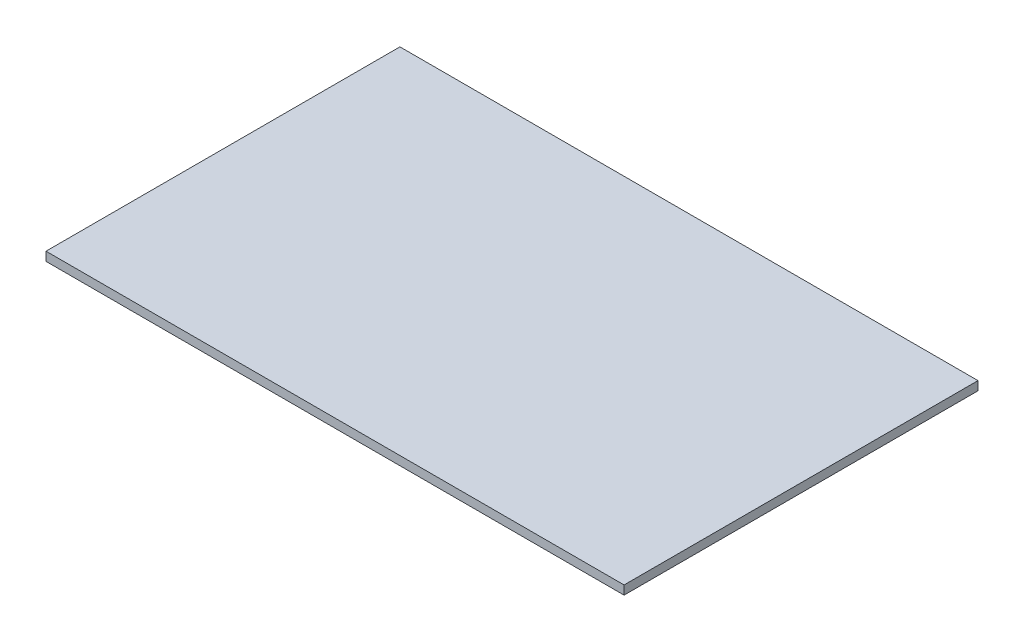
ISO-10303-21;
HEADER;
FILE_DESCRIPTION(('STEP AP214'),'2;1');
FILE_NAME('part.step','',(''),(''),'','','');
FILE_SCHEMA(('AUTOMOTIVE_DESIGN { 1 0 10303 214 1 1 1 1 }'));
ENDSEC;
DATA;
#1=APPLICATION_CONTEXT('core data for automotive mechanical design processes');
#2=APPLICATION_PROTOCOL_DEFINITION('international standard','automotive_design',2000,#1);
#3=PRODUCT_CONTEXT('',#1,'mechanical');
#4=PRODUCT('Part','Part','',(#3));
#5=PRODUCT_RELATED_PRODUCT_CATEGORY('part','',(#4));
#6=PRODUCT_DEFINITION_FORMATION('','',#4);
#7=PRODUCT_DEFINITION_CONTEXT('part definition',#1,'design');
#8=PRODUCT_DEFINITION('design','',#6,#7);
#9=PRODUCT_DEFINITION_SHAPE('','',#8);
#10=(LENGTH_UNIT() NAMED_UNIT(*) SI_UNIT(.MILLI.,.METRE.));
#11=(NAMED_UNIT(*) PLANE_ANGLE_UNIT() SI_UNIT($,.RADIAN.));
#12=(NAMED_UNIT(*) SI_UNIT($,.STERADIAN.) SOLID_ANGLE_UNIT());
#13=UNCERTAINTY_MEASURE_WITH_UNIT(LENGTH_MEASURE(1.E-05),#10,'distance_accuracy_value','');
#14=(GEOMETRIC_REPRESENTATION_CONTEXT(3) GLOBAL_UNCERTAINTY_ASSIGNED_CONTEXT((#13)) GLOBAL_UNIT_ASSIGNED_CONTEXT((#10,
#11,#12)) REPRESENTATION_CONTEXT('',''));
#15=CARTESIAN_POINT('',(0.,0.,0.));
#16=DIRECTION('',(0.,0.,1.));
#17=DIRECTION('',(1.,0.,0.));
#18=AXIS2_PLACEMENT_3D('',#15,#16,#17);
#19=CARTESIAN_POINT('',(49.,1.5,-30.));
#20=DIRECTION('',(-1.,0.,0.));
#21=DIRECTION('',(0.,0.,1.));
#22=AXIS2_PLACEMENT_3D('',#19,#20,#21);
#23=PLANE('',#22);
#24=DIRECTION('',(0.,0.,-1.));
#25=VECTOR('',#24,1.);
#26=CARTESIAN_POINT('',(49.,0.,-30.));
#27=LINE('',#26,#25);
#28=CARTESIAN_POINT('',(49.,0.,30.));
#29=VERTEX_POINT('',#28);
#30=CARTESIAN_POINT('',(49.,0.,-30.));
#31=VERTEX_POINT('',#30);
#32=EDGE_CURVE('E98',#29,#31,#27,.T.);
#33=ORIENTED_EDGE('',*,*,#32,.T.);
#34=DIRECTION('',(0.,-1.,0.));
#35=VECTOR('',#34,1.);
#36=CARTESIAN_POINT('',(49.,1.5,-30.));
#37=LINE('',#36,#35);
#38=CARTESIAN_POINT('',(49.,1.5,-30.));
#39=VERTEX_POINT('',#38);
#40=EDGE_CURVE('E11',#39,#31,#37,.T.);
#41=ORIENTED_EDGE('',*,*,#40,.F.);
#42=DIRECTION('',(0.,0.,-1.));
#43=VECTOR('',#42,1.);
#44=CARTESIAN_POINT('',(49.,1.5,-30.));
#45=LINE('',#44,#43);
#46=CARTESIAN_POINT('',(49.,1.5,30.));
#47=VERTEX_POINT('',#46);
#48=EDGE_CURVE('E86',#47,#39,#45,.T.);
#49=ORIENTED_EDGE('',*,*,#48,.F.);
#50=DIRECTION('',(0.,-1.,0.));
#51=VECTOR('',#50,1.);
#52=CARTESIAN_POINT('',(49.,1.5,30.));
#53=LINE('',#52,#51);
#54=EDGE_CURVE('E94',#47,#29,#53,.T.);
#55=ORIENTED_EDGE('',*,*,#54,.T.);
#56=EDGE_LOOP('',(#33,#41,#49,#55));
#57=FACE_BOUND('',#56,.T.);
#58=ADVANCED_FACE('F35',(#57),#23,.F.);
#59=CARTESIAN_POINT('',(-49.,1.5,-30.));
#60=DIRECTION('',(0.,0.,1.));
#61=DIRECTION('',(1.,0.,0.));
#62=AXIS2_PLACEMENT_3D('',#59,#60,#61);
#63=PLANE('',#62);
#64=DIRECTION('',(-1.,0.,0.));
#65=VECTOR('',#64,1.);
#66=CARTESIAN_POINT('',(-49.,0.,-30.));
#67=LINE('',#66,#65);
#68=CARTESIAN_POINT('',(-49.,0.,-30.));
#69=VERTEX_POINT('',#68);
#70=EDGE_CURVE('E90',#31,#69,#67,.T.);
#71=ORIENTED_EDGE('',*,*,#70,.T.);
#72=DIRECTION('',(0.,-1.,0.));
#73=VECTOR('',#72,1.);
#74=CARTESIAN_POINT('',(-49.,1.5,-30.));
#75=LINE('',#74,#73);
#76=CARTESIAN_POINT('',(-49.,1.5,-30.));
#77=VERTEX_POINT('',#76);
#78=EDGE_CURVE('E43',#77,#69,#75,.T.);
#79=ORIENTED_EDGE('',*,*,#78,.F.);
#80=DIRECTION('',(-1.,0.,0.));
#81=VECTOR('',#80,1.);
#82=CARTESIAN_POINT('',(-49.,1.5,-30.));
#83=LINE('',#82,#81);
#84=EDGE_CURVE('E81',#39,#77,#83,.T.);
#85=ORIENTED_EDGE('',*,*,#84,.F.);
#86=ORIENTED_EDGE('',*,*,#40,.T.);
#87=EDGE_LOOP('',(#71,#79,#85,#86));
#88=FACE_BOUND('',#87,.T.);
#89=ADVANCED_FACE('F89',(#88),#63,.F.);
#90=CARTESIAN_POINT('',(-49.,1.5,-30.));
#91=DIRECTION('',(1.,0.,0.));
#92=DIRECTION('',(0.,0.,-1.));
#93=AXIS2_PLACEMENT_3D('',#90,#91,#92);
#94=PLANE('',#93);
#95=DIRECTION('',(0.,0.,1.));
#96=VECTOR('',#95,1.);
#97=CARTESIAN_POINT('',(-49.,0.,-30.));
#98=LINE('',#97,#96);
#99=CARTESIAN_POINT('',(-49.,0.,30.));
#100=VERTEX_POINT('',#99);
#101=EDGE_CURVE('E68',#69,#100,#98,.T.);
#102=ORIENTED_EDGE('',*,*,#101,.T.);
#103=DIRECTION('',(0.,-1.,0.));
#104=VECTOR('',#103,1.);
#105=CARTESIAN_POINT('',(-49.,1.5,30.));
#106=LINE('',#105,#104);
#107=CARTESIAN_POINT('',(-49.,1.5,30.));
#108=VERTEX_POINT('',#107);
#109=EDGE_CURVE('E91',#108,#100,#106,.T.);
#110=ORIENTED_EDGE('',*,*,#109,.F.);
#111=DIRECTION('',(0.,0.,1.));
#112=VECTOR('',#111,1.);
#113=CARTESIAN_POINT('',(-49.,1.5,-30.));
#114=LINE('',#113,#112);
#115=EDGE_CURVE('E84',#77,#108,#114,.T.);
#116=ORIENTED_EDGE('',*,*,#115,.F.);
#117=ORIENTED_EDGE('',*,*,#78,.T.);
#118=EDGE_LOOP('',(#102,#110,#116,#117));
#119=FACE_BOUND('',#118,.T.);
#120=ADVANCED_FACE('F92',(#119),#94,.F.);
#121=CARTESIAN_POINT('',(-49.,1.5,30.));
#122=DIRECTION('',(0.,0.,-1.));
#123=DIRECTION('',(-1.,0.,0.));
#124=AXIS2_PLACEMENT_3D('',#121,#122,#123);
#125=PLANE('',#124);
#126=DIRECTION('',(1.,0.,0.));
#127=VECTOR('',#126,1.);
#128=CARTESIAN_POINT('',(-49.,0.,30.));
#129=LINE('',#128,#127);
#130=EDGE_CURVE('E74',#100,#29,#129,.T.);
#131=ORIENTED_EDGE('',*,*,#130,.T.);
#132=ORIENTED_EDGE('',*,*,#54,.F.);
#133=DIRECTION('',(1.,0.,0.));
#134=VECTOR('',#133,1.);
#135=CARTESIAN_POINT('',(-49.,1.5,30.));
#136=LINE('',#135,#134);
#137=EDGE_CURVE('E51',#108,#47,#136,.T.);
#138=ORIENTED_EDGE('',*,*,#137,.F.);
#139=ORIENTED_EDGE('',*,*,#109,.T.);
#140=EDGE_LOOP('',(#131,#132,#138,#139));
#141=FACE_BOUND('',#140,.T.);
#142=ADVANCED_FACE('F105',(#141),#125,.F.);
#143=CARTESIAN_POINT('',(0.,1.5,0.));
#144=DIRECTION('',(0.,1.,0.));
#145=DIRECTION('',(0.,0.,1.));
#146=AXIS2_PLACEMENT_3D('',#143,#144,#145);
#147=PLANE('',#146);
#148=ORIENTED_EDGE('',*,*,#48,.T.);
#149=ORIENTED_EDGE('',*,*,#84,.T.);
#150=ORIENTED_EDGE('',*,*,#115,.T.);
#151=ORIENTED_EDGE('',*,*,#137,.T.);
#152=EDGE_LOOP('',(#148,#149,#150,#151));
#153=FACE_BOUND('',#152,.T.);
#154=ADVANCED_FACE('F82',(#153),#147,.T.);
#155=CARTESIAN_POINT('',(0.,0.,0.));
#156=DIRECTION('',(0.,1.,0.));
#157=DIRECTION('',(0.,0.,1.));
#158=AXIS2_PLACEMENT_3D('',#155,#156,#157);
#159=PLANE('',#158);
#160=ORIENTED_EDGE('',*,*,#32,.F.);
#161=ORIENTED_EDGE('',*,*,#130,.F.);
#162=ORIENTED_EDGE('',*,*,#101,.F.);
#163=ORIENTED_EDGE('',*,*,#70,.F.);
#164=EDGE_LOOP('',(#160,#161,#162,#163));
#165=FACE_BOUND('',#164,.T.);
#166=ADVANCED_FACE('F108',(#165),#159,.F.);
#167=CLOSED_SHELL('',(#58,#89,#120,#142,#154,#166));
#168=MANIFOLD_SOLID_BREP('B2',#167);
#169=ADVANCED_BREP_SHAPE_REPRESENTATION('',(#18,#168),#14);
#170=SHAPE_DEFINITION_REPRESENTATION(#9,#169);
ENDSEC;
END-ISO-10303-21;
